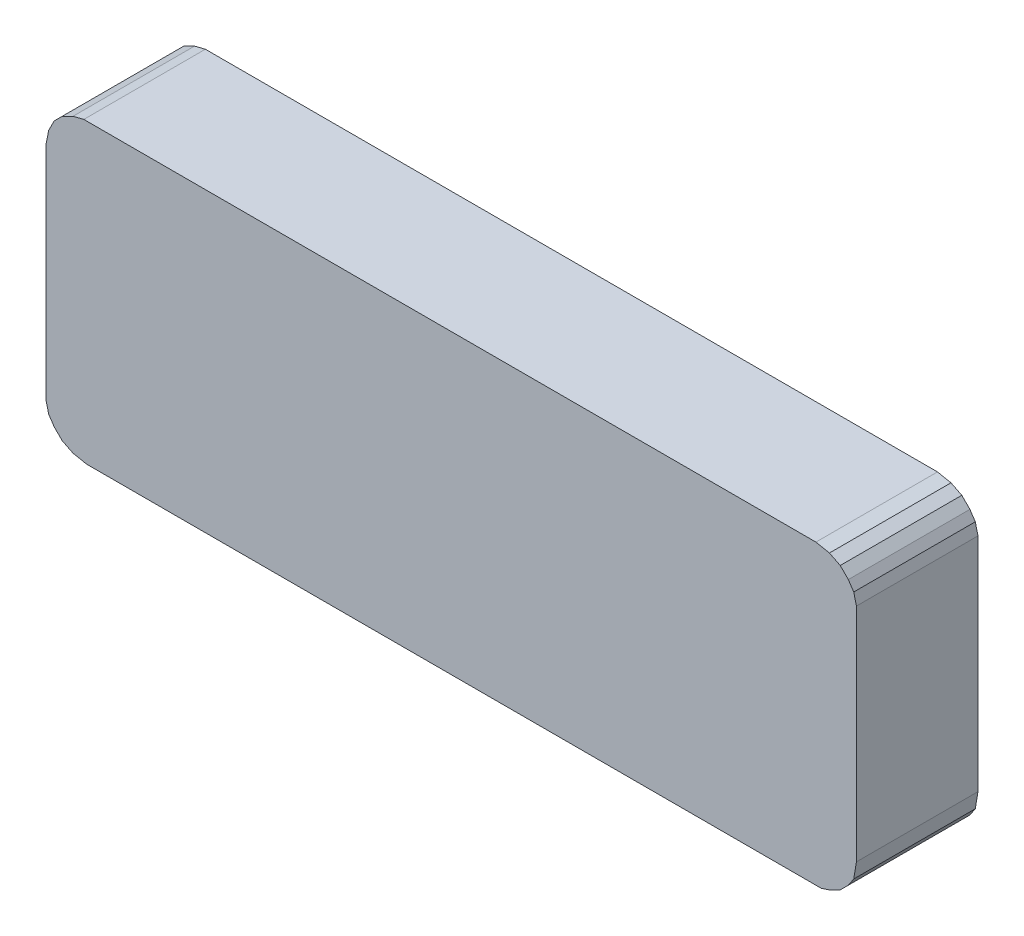
ISO-10303-21;
HEADER;
FILE_DESCRIPTION(('STEP AP214'),'2;1');
FILE_NAME('part.step','',(''),(''),'','','');
FILE_SCHEMA(('AUTOMOTIVE_DESIGN { 1 0 10303 214 1 1 1 1 }'));
ENDSEC;
DATA;
#1=APPLICATION_CONTEXT('core data for automotive mechanical design processes');
#2=APPLICATION_PROTOCOL_DEFINITION('international standard','automotive_design',2000,#1);
#3=PRODUCT_CONTEXT('',#1,'mechanical');
#4=PRODUCT('Part','Part','',(#3));
#5=PRODUCT_RELATED_PRODUCT_CATEGORY('part','',(#4));
#6=PRODUCT_DEFINITION_FORMATION('','',#4);
#7=PRODUCT_DEFINITION_CONTEXT('part definition',#1,'design');
#8=PRODUCT_DEFINITION('design','',#6,#7);
#9=PRODUCT_DEFINITION_SHAPE('','',#8);
#10=(LENGTH_UNIT() NAMED_UNIT(*) SI_UNIT(.MILLI.,.METRE.));
#11=(NAMED_UNIT(*) PLANE_ANGLE_UNIT() SI_UNIT($,.RADIAN.));
#12=(NAMED_UNIT(*) SI_UNIT($,.STERADIAN.) SOLID_ANGLE_UNIT());
#13=UNCERTAINTY_MEASURE_WITH_UNIT(LENGTH_MEASURE(1.E-05),#10,'distance_accuracy_value','');
#14=(GEOMETRIC_REPRESENTATION_CONTEXT(3) GLOBAL_UNCERTAINTY_ASSIGNED_CONTEXT((#13)) GLOBAL_UNIT_ASSIGNED_CONTEXT((#10,
#11,#12)) REPRESENTATION_CONTEXT('',''));
#15=CARTESIAN_POINT('',(0.,0.,0.));
#16=DIRECTION('',(0.,0.,1.));
#17=DIRECTION('',(1.,0.,0.));
#18=AXIS2_PLACEMENT_3D('',#15,#16,#17);
#19=CARTESIAN_POINT('',(-1.49999954,0.40000174,0.45));
#20=DIRECTION('',(0.,0.,1.));
#21=DIRECTION('',(1.,0.,0.));
#22=AXIS2_PLACEMENT_3D('',#19,#20,#21);
#23=PLANE('',#22);
#24=DIRECTION('',(-0.447213595499958,-0.894427190999916,0.));
#25=VECTOR('',#24,1.);
#26=CARTESIAN_POINT('',(-1.4699996,0.49000156,0.45));
#27=LINE('',#26,#25);
#28=CARTESIAN_POINT('',(-1.4699996,0.49000156,0.45));
#29=VERTEX_POINT('',#28);
#30=CARTESIAN_POINT('',(-1.48999956,0.45000164,0.45));
#31=VERTEX_POINT('',#30);
#32=EDGE_CURVE('E196',#29,#31,#27,.T.);
#33=ORIENTED_EDGE('',*,*,#32,.T.);
#34=DIRECTION('',(-0.196116135138182,-0.980580675690921,0.));
#35=VECTOR('',#34,1.);
#36=CARTESIAN_POINT('',(-1.48999956,0.45000164,0.45));
#37=LINE('',#36,#35);
#38=CARTESIAN_POINT('',(-1.49999954,0.40000174,0.45));
#39=VERTEX_POINT('',#38);
#40=EDGE_CURVE('E200',#31,#39,#37,.T.);
#41=ORIENTED_EDGE('',*,*,#40,.T.);
#42=DIRECTION('',(0.,1.,0.));
#43=VECTOR('',#42,1.);
#44=CARTESIAN_POINT('',(-1.49999954,-0.41999916,0.45));
#45=LINE('',#44,#43);
#46=CARTESIAN_POINT('',(-1.49999954,-0.419999159999998,0.45));
#47=VERTEX_POINT('',#46);
#48=EDGE_CURVE('E202',#47,#39,#45,.T.);
#49=ORIENTED_EDGE('',*,*,#48,.F.);
#50=DIRECTION('',(0.242535625036098,-0.970142500145391,0.));
#51=VECTOR('',#50,1.);
#52=CARTESIAN_POINT('',(-1.48999956,-0.45999908,0.45));
#53=LINE('',#52,#51);
#54=CARTESIAN_POINT('',(-1.48999956,-0.459999079999999,0.45));
#55=VERTEX_POINT('',#54);
#56=EDGE_CURVE('E205',#55,#47,#53,.F.);
#57=ORIENTED_EDGE('',*,*,#56,.F.);
#58=DIRECTION('',(0.554700196224998,-0.832050294337997,0.));
#59=VECTOR('',#58,1.);
#60=CARTESIAN_POINT('',(-1.4699996,-0.48999902,0.45));
#61=LINE('',#60,#59);
#62=CARTESIAN_POINT('',(-1.4699996,-0.48999902,0.45));
#63=VERTEX_POINT('',#62);
#64=EDGE_CURVE('E209',#63,#55,#61,.F.);
#65=ORIENTED_EDGE('',*,*,#64,.F.);
#66=DIRECTION('',(0.707106781186548,-0.707106781186548,0.));
#67=VECTOR('',#66,1.);
#68=CARTESIAN_POINT('',(-1.43999966,-0.51999896,0.45));
#69=LINE('',#68,#67);
#70=CARTESIAN_POINT('',(-1.43999966,-0.51999896,0.45));
#71=VERTEX_POINT('',#70);
#72=EDGE_CURVE('E213',#71,#63,#69,.F.);
#73=ORIENTED_EDGE('',*,*,#72,.F.);
#74=DIRECTION('',(0.894427190999916,-0.447213595499958,0.));
#75=VECTOR('',#74,1.);
#76=CARTESIAN_POINT('',(-1.39999974,-0.53999892,0.45));
#77=LINE('',#76,#75);
#78=CARTESIAN_POINT('',(-1.39999974,-0.539998920000002,0.45));
#79=VERTEX_POINT('',#78);
#80=EDGE_CURVE('E217',#79,#71,#77,.F.);
#81=ORIENTED_EDGE('',*,*,#80,.F.);
#82=DIRECTION('',(0.980580675690959,-0.196116135137992,0.));
#83=VECTOR('',#82,1.);
#84=CARTESIAN_POINT('',(-1.34999984,-0.5499989,0.45));
#85=LINE('',#84,#83);
#86=CARTESIAN_POINT('',(-1.34999984,-0.5499989,0.45));
#87=VERTEX_POINT('',#86);
#88=EDGE_CURVE('E221',#87,#79,#85,.F.);
#89=ORIENTED_EDGE('',*,*,#88,.F.);
#90=DIRECTION('',(1.,0.,0.));
#91=VECTOR('',#90,1.);
#92=CARTESIAN_POINT('',(1.3699998,-0.5499989,0.45));
#93=LINE('',#92,#91);
#94=CARTESIAN_POINT('',(1.3699998,-0.549998900000003,0.45));
#95=VERTEX_POINT('',#94);
#96=EDGE_CURVE('E225',#95,#87,#93,.F.);
#97=ORIENTED_EDGE('',*,*,#96,.F.);
#98=DIRECTION('',(0.948683298050414,0.316227766017138,0.));
#99=VECTOR('',#98,1.);
#100=CARTESIAN_POINT('',(1.39999974,-0.53999892,0.45));
#101=LINE('',#100,#99);
#102=CARTESIAN_POINT('',(1.39999974,-0.53999892,0.45));
#103=VERTEX_POINT('',#102);
#104=EDGE_CURVE('E229',#103,#95,#101,.F.);
#105=ORIENTED_EDGE('',*,*,#104,.F.);
#106=DIRECTION('',(0.894427190999916,0.447213595499958,0.));
#107=VECTOR('',#106,1.);
#108=CARTESIAN_POINT('',(1.43999966,-0.51999896,0.45));
#109=LINE('',#108,#107);
#110=CARTESIAN_POINT('',(1.43999965999999,-0.519998959999995,0.45));
#111=VERTEX_POINT('',#110);
#112=EDGE_CURVE('E233',#111,#103,#109,.F.);
#113=ORIENTED_EDGE('',*,*,#112,.F.);
#114=DIRECTION('',(0.707106781187048,0.707106781186048,0.));
#115=VECTOR('',#114,1.);
#116=CARTESIAN_POINT('',(1.4699996,-0.48999902,0.45));
#117=LINE('',#116,#115);
#118=CARTESIAN_POINT('',(1.4699996,-0.489999020000001,0.45));
#119=VERTEX_POINT('',#118);
#120=EDGE_CURVE('E237',#119,#111,#117,.F.);
#121=ORIENTED_EDGE('',*,*,#120,.F.);
#122=DIRECTION('',(0.554700196224998,0.832050294337997,0.));
#123=VECTOR('',#122,1.);
#124=CARTESIAN_POINT('',(1.48999956,-0.45999908,0.45));
#125=LINE('',#124,#123);
#126=CARTESIAN_POINT('',(1.48999956,-0.459999080000001,0.45));
#127=VERTEX_POINT('',#126);
#128=EDGE_CURVE('E241',#127,#119,#125,.F.);
#129=ORIENTED_EDGE('',*,*,#128,.F.);
#130=DIRECTION('',(0.164398987305033,0.986393923832198,0.));
#131=VECTOR('',#130,1.);
#132=CARTESIAN_POINT('',(1.49999954,-0.3999992,0.45));
#133=LINE('',#132,#131);
#134=CARTESIAN_POINT('',(1.49999954,-0.399999199999999,0.45));
#135=VERTEX_POINT('',#134);
#136=EDGE_CURVE('E245',#135,#127,#133,.F.);
#137=ORIENTED_EDGE('',*,*,#136,.F.);
#138=DIRECTION('',(0.,1.,0.));
#139=VECTOR('',#138,1.);
#140=CARTESIAN_POINT('',(1.49999954,0.4200017,0.45));
#141=LINE('',#140,#139);
#142=CARTESIAN_POINT('',(1.49999954,0.420001699999999,0.45));
#143=VERTEX_POINT('',#142);
#144=EDGE_CURVE('E249',#143,#135,#141,.F.);
#145=ORIENTED_EDGE('',*,*,#144,.F.);
#146=DIRECTION('',(-0.242535625036098,0.970142500145391,0.));
#147=VECTOR('',#146,1.);
#148=CARTESIAN_POINT('',(1.48999956,0.46000162,0.45));
#149=LINE('',#148,#147);
#150=CARTESIAN_POINT('',(1.48999956,0.460001619999999,0.45));
#151=VERTEX_POINT('',#150);
#152=EDGE_CURVE('E253',#151,#143,#149,.F.);
#153=ORIENTED_EDGE('',*,*,#152,.F.);
#154=DIRECTION('',(-0.554700196224998,0.832050294337997,0.));
#155=VECTOR('',#154,1.);
#156=CARTESIAN_POINT('',(1.4699996,0.49000156,0.45));
#157=LINE('',#156,#155);
#158=CARTESIAN_POINT('',(1.4699996,0.49000156,0.45));
#159=VERTEX_POINT('',#158);
#160=EDGE_CURVE('E257',#159,#151,#157,.F.);
#161=ORIENTED_EDGE('',*,*,#160,.F.);
#162=DIRECTION('',(-0.707106781186548,0.707106781186548,0.));
#163=VECTOR('',#162,1.);
#164=CARTESIAN_POINT('',(1.43999966,0.5200015,0.45));
#165=LINE('',#164,#163);
#166=CARTESIAN_POINT('',(1.43999966,0.5200015,0.45));
#167=VERTEX_POINT('',#166);
#168=EDGE_CURVE('E261',#167,#159,#165,.F.);
#169=ORIENTED_EDGE('',*,*,#168,.F.);
#170=DIRECTION('',(-0.894427190999916,0.447213595499958,0.));
#171=VECTOR('',#170,1.);
#172=CARTESIAN_POINT('',(1.39999974,0.54000146,0.45));
#173=LINE('',#172,#171);
#174=CARTESIAN_POINT('',(1.39999974,0.540001460000002,0.45));
#175=VERTEX_POINT('',#174);
#176=EDGE_CURVE('E265',#175,#167,#173,.F.);
#177=ORIENTED_EDGE('',*,*,#176,.F.);
#178=DIRECTION('',(-0.980580675690959,0.196116135137992,0.));
#179=VECTOR('',#178,1.);
#180=CARTESIAN_POINT('',(1.34999984,0.55000144,0.45));
#181=LINE('',#180,#179);
#182=CARTESIAN_POINT('',(1.34999984,0.55000144,0.45));
#183=VERTEX_POINT('',#182);
#184=EDGE_CURVE('E269',#183,#175,#181,.F.);
#185=ORIENTED_EDGE('',*,*,#184,.F.);
#186=DIRECTION('',(1.,0.,0.));
#187=VECTOR('',#186,1.);
#188=CARTESIAN_POINT('',(-1.35999982,0.55000144,0.45));
#189=LINE('',#188,#187);
#190=CARTESIAN_POINT('',(-1.35999982,0.550001439999997,0.45));
#191=VERTEX_POINT('',#190);
#192=EDGE_CURVE('E179',#191,#183,#189,.T.);
#193=ORIENTED_EDGE('',*,*,#192,.F.);
#194=DIRECTION('',(-0.970142500145332,-0.242535625036332,0.));
#195=VECTOR('',#194,1.);
#196=CARTESIAN_POINT('',(-1.35999982,0.55000144,0.45));
#197=LINE('',#196,#195);
#198=CARTESIAN_POINT('',(-1.39999974,0.54000146,0.45));
#199=VERTEX_POINT('',#198);
#200=EDGE_CURVE('E19',#191,#199,#197,.T.);
#201=ORIENTED_EDGE('',*,*,#200,.T.);
#202=DIRECTION('',(-0.894427190999917,-0.447213595499956,0.));
#203=VECTOR('',#202,1.);
#204=CARTESIAN_POINT('',(-1.39999974,0.54000146,0.45));
#205=LINE('',#204,#203);
#206=CARTESIAN_POINT('',(-1.43999966000001,0.520001500000005,0.45));
#207=VERTEX_POINT('',#206);
#208=EDGE_CURVE('E174',#199,#207,#205,.T.);
#209=ORIENTED_EDGE('',*,*,#208,.T.);
#210=DIRECTION('',(-0.707106781186546,-0.707106781186549,0.));
#211=VECTOR('',#210,1.);
#212=CARTESIAN_POINT('',(-1.43999966,0.5200015,0.45));
#213=LINE('',#212,#211);
#214=EDGE_CURVE('E195',#207,#29,#213,.T.);
#215=ORIENTED_EDGE('',*,*,#214,.T.);
#216=EDGE_LOOP('',(#33,#41,#49,#57,#65,#73,#81,#89,#97,#105,#113,#121,#129,#137,#145,#153,#161,
#169,#177,#185,#193,#201,#209,#215));
#217=FACE_BOUND('',#216,.T.);
#218=ADVANCED_FACE('F16',(#217),#23,.T.);
#219=CARTESIAN_POINT('',(-1.49999954,-0.41999916,0.));
#220=DIRECTION('',(-1.,0.,0.));
#221=DIRECTION('',(0.,0.,1.));
#222=AXIS2_PLACEMENT_3D('',#219,#220,#221);
#223=PLANE('',#222);
#224=DIRECTION('',(0.,0.,1.));
#225=VECTOR('',#224,1.);
#226=CARTESIAN_POINT('',(-1.49999954,0.40000174,0.));
#227=LINE('',#226,#225);
#228=CARTESIAN_POINT('',(-1.49999954,0.40000174,0.));
#229=VERTEX_POINT('',#228);
#230=EDGE_CURVE('E280',#229,#39,#227,.T.);
#231=ORIENTED_EDGE('',*,*,#230,.F.);
#232=DIRECTION('',(0.,1.,0.));
#233=VECTOR('',#232,1.);
#234=CARTESIAN_POINT('',(-1.49999954,0.40000174,0.));
#235=LINE('',#234,#233);
#236=CARTESIAN_POINT('',(-1.49999954,-0.419999159999999,0.));
#237=VERTEX_POINT('',#236);
#238=EDGE_CURVE('E284',#229,#237,#235,.F.);
#239=ORIENTED_EDGE('',*,*,#238,.T.);
#240=DIRECTION('',(0.,0.,1.));
#241=VECTOR('',#240,1.);
#242=CARTESIAN_POINT('',(-1.49999953999999,-0.419999159999998,0.));
#243=LINE('',#242,#241);
#244=EDGE_CURVE('E207',#47,#237,#243,.F.);
#245=ORIENTED_EDGE('',*,*,#244,.F.);
#246=ORIENTED_EDGE('',*,*,#48,.T.);
#247=EDGE_LOOP('',(#231,#239,#245,#246));
#248=FACE_BOUND('',#247,.T.);
#249=ADVANCED_FACE('F363',(#248),#223,.T.);
#250=CARTESIAN_POINT('',(-1.48999956,-0.45999908,0.));
#251=DIRECTION('',(-0.970142500145391,-0.242535625036098,0.));
#252=DIRECTION('',(0.242535625036098,-0.970142500145391,0.));
#253=AXIS2_PLACEMENT_3D('',#250,#251,#252);
#254=PLANE('',#253);
#255=ORIENTED_EDGE('',*,*,#244,.T.);
#256=DIRECTION('',(0.24253562503633,-0.970142500145333,0.));
#257=VECTOR('',#256,1.);
#258=CARTESIAN_POINT('',(-1.49999954,-0.41999916,0.));
#259=LINE('',#258,#257);
#260=CARTESIAN_POINT('',(-1.48999956,-0.459999079999999,0.));
#261=VERTEX_POINT('',#260);
#262=EDGE_CURVE('E287',#237,#261,#259,.T.);
#263=ORIENTED_EDGE('',*,*,#262,.T.);
#264=DIRECTION('',(0.,0.,1.));
#265=VECTOR('',#264,1.);
#266=CARTESIAN_POINT('',(-1.48999955999999,-0.459999079999994,0.));
#267=LINE('',#266,#265);
#268=EDGE_CURVE('E211',#55,#261,#267,.F.);
#269=ORIENTED_EDGE('',*,*,#268,.F.);
#270=ORIENTED_EDGE('',*,*,#56,.T.);
#271=EDGE_LOOP('',(#255,#263,#269,#270));
#272=FACE_BOUND('',#271,.T.);
#273=ADVANCED_FACE('F448',(#272),#254,.T.);
#274=CARTESIAN_POINT('',(-1.4699996,-0.48999902,0.));
#275=DIRECTION('',(-0.832050294337997,-0.554700196224998,0.));
#276=DIRECTION('',(0.554700196224998,-0.832050294337997,0.));
#277=AXIS2_PLACEMENT_3D('',#274,#275,#276);
#278=PLANE('',#277);
#279=ORIENTED_EDGE('',*,*,#268,.T.);
#280=DIRECTION('',(0.55470019622523,-0.832050294337843,0.));
#281=VECTOR('',#280,1.);
#282=CARTESIAN_POINT('',(-1.48999956,-0.45999908,0.));
#283=LINE('',#282,#281);
#284=CARTESIAN_POINT('',(-1.4699996,-0.48999902,0.));
#285=VERTEX_POINT('',#284);
#286=EDGE_CURVE('E290',#261,#285,#283,.T.);
#287=ORIENTED_EDGE('',*,*,#286,.T.);
#288=DIRECTION('',(0.,0.,1.));
#289=VECTOR('',#288,1.);
#290=CARTESIAN_POINT('',(-1.4699996,-0.48999902,0.));
#291=LINE('',#290,#289);
#292=EDGE_CURVE('E215',#63,#285,#291,.F.);
#293=ORIENTED_EDGE('',*,*,#292,.F.);
#294=ORIENTED_EDGE('',*,*,#64,.T.);
#295=EDGE_LOOP('',(#279,#287,#293,#294));
#296=FACE_BOUND('',#295,.T.);
#297=ADVANCED_FACE('F444',(#296),#278,.T.);
#298=CARTESIAN_POINT('',(-1.43999966,-0.51999896,0.));
#299=DIRECTION('',(-0.707106781186548,-0.707106781186548,0.));
#300=DIRECTION('',(0.707106781186548,-0.707106781186548,0.));
#301=AXIS2_PLACEMENT_3D('',#298,#299,#300);
#302=PLANE('',#301);
#303=ORIENTED_EDGE('',*,*,#292,.T.);
#304=DIRECTION('',(0.707106781186545,-0.70710678118655,0.));
#305=VECTOR('',#304,1.);
#306=CARTESIAN_POINT('',(-1.4699996,-0.48999902,0.));
#307=LINE('',#306,#305);
#308=CARTESIAN_POINT('',(-1.43999966,-0.51999896,0.));
#309=VERTEX_POINT('',#308);
#310=EDGE_CURVE('E293',#285,#309,#307,.T.);
#311=ORIENTED_EDGE('',*,*,#310,.T.);
#312=DIRECTION('',(0.,0.,1.));
#313=VECTOR('',#312,1.);
#314=CARTESIAN_POINT('',(-1.43999966,-0.51999896,0.));
#315=LINE('',#314,#313);
#316=EDGE_CURVE('E219',#71,#309,#315,.F.);
#317=ORIENTED_EDGE('',*,*,#316,.F.);
#318=ORIENTED_EDGE('',*,*,#72,.T.);
#319=EDGE_LOOP('',(#303,#311,#317,#318));
#320=FACE_BOUND('',#319,.T.);
#321=ADVANCED_FACE('F440',(#320),#302,.T.);
#322=CARTESIAN_POINT('',(-1.39999974,-0.53999892,0.));
#323=DIRECTION('',(-0.447213595499958,-0.894427190999916,0.));
#324=DIRECTION('',(0.894427190999916,-0.447213595499958,0.));
#325=AXIS2_PLACEMENT_3D('',#322,#323,#324);
#326=PLANE('',#325);
#327=ORIENTED_EDGE('',*,*,#316,.T.);
#328=DIRECTION('',(0.894427190999917,-0.447213595499956,0.));
#329=VECTOR('',#328,1.);
#330=CARTESIAN_POINT('',(-1.43999966,-0.51999896,0.));
#331=LINE('',#330,#329);
#332=CARTESIAN_POINT('',(-1.39999974,-0.539998920000002,0.));
#333=VERTEX_POINT('',#332);
#334=EDGE_CURVE('E296',#309,#333,#331,.T.);
#335=ORIENTED_EDGE('',*,*,#334,.T.);
#336=DIRECTION('',(0.,0.,1.));
#337=VECTOR('',#336,1.);
#338=CARTESIAN_POINT('',(-1.39999974,-0.53999892000001,0.));
#339=LINE('',#338,#337);
#340=EDGE_CURVE('E223',#79,#333,#339,.F.);
#341=ORIENTED_EDGE('',*,*,#340,.F.);
#342=ORIENTED_EDGE('',*,*,#80,.T.);
#343=EDGE_LOOP('',(#327,#335,#341,#342));
#344=FACE_BOUND('',#343,.T.);
#345=ADVANCED_FACE('F436',(#344),#326,.T.);
#346=CARTESIAN_POINT('',(-1.34999984,-0.5499989,0.));
#347=DIRECTION('',(-0.196116135137992,-0.980580675690959,0.));
#348=DIRECTION('',(0.980580675690959,-0.196116135137992,0.));
#349=AXIS2_PLACEMENT_3D('',#346,#347,#348);
#350=PLANE('',#349);
#351=ORIENTED_EDGE('',*,*,#340,.T.);
#352=DIRECTION('',(0.980580675690921,-0.196116135138182,0.));
#353=VECTOR('',#352,1.);
#354=CARTESIAN_POINT('',(-1.39999974,-0.53999892,0.));
#355=LINE('',#354,#353);
#356=CARTESIAN_POINT('',(-1.34999984,-0.5499989,0.));
#357=VERTEX_POINT('',#356);
#358=EDGE_CURVE('E299',#333,#357,#355,.T.);
#359=ORIENTED_EDGE('',*,*,#358,.T.);
#360=DIRECTION('',(0.,0.,-1.));
#361=VECTOR('',#360,1.);
#362=CARTESIAN_POINT('',(-1.34999984,-0.5499989,0.));
#363=LINE('',#362,#361);
#364=EDGE_CURVE('E227',#87,#357,#363,.T.);
#365=ORIENTED_EDGE('',*,*,#364,.F.);
#366=ORIENTED_EDGE('',*,*,#88,.T.);
#367=EDGE_LOOP('',(#351,#359,#365,#366));
#368=FACE_BOUND('',#367,.T.);
#369=ADVANCED_FACE('F432',(#368),#350,.T.);
#370=CARTESIAN_POINT('',(1.3699998,-0.5499989,0.));
#371=DIRECTION('',(0.,-1.,0.));
#372=DIRECTION('',(0.,0.,-1.));
#373=AXIS2_PLACEMENT_3D('',#370,#371,#372);
#374=PLANE('',#373);
#375=ORIENTED_EDGE('',*,*,#364,.T.);
#376=DIRECTION('',(1.,0.,0.));
#377=VECTOR('',#376,1.);
#378=CARTESIAN_POINT('',(-1.49999954,-0.5499989,0.));
#379=LINE('',#378,#377);
#380=CARTESIAN_POINT('',(1.3699998,-0.549998900000003,0.));
#381=VERTEX_POINT('',#380);
#382=EDGE_CURVE('E302',#357,#381,#379,.T.);
#383=ORIENTED_EDGE('',*,*,#382,.T.);
#384=DIRECTION('',(0.,0.,1.));
#385=VECTOR('',#384,1.);
#386=CARTESIAN_POINT('',(1.3699998,-0.54999890000001,0.));
#387=LINE('',#386,#385);
#388=EDGE_CURVE('E231',#95,#381,#387,.F.);
#389=ORIENTED_EDGE('',*,*,#388,.F.);
#390=ORIENTED_EDGE('',*,*,#96,.T.);
#391=EDGE_LOOP('',(#375,#383,#389,#390));
#392=FACE_BOUND('',#391,.T.);
#393=ADVANCED_FACE('F428',(#392),#374,.T.);
#394=CARTESIAN_POINT('',(1.39999974,-0.53999892,0.));
#395=DIRECTION('',(0.316227766017138,-0.948683298050414,0.));
#396=DIRECTION('',(0.948683298050414,0.316227766017138,0.));
#397=AXIS2_PLACEMENT_3D('',#394,#395,#396);
#398=PLANE('',#397);
#399=ORIENTED_EDGE('',*,*,#388,.T.);
#400=DIRECTION('',(0.948683298050515,0.316227766016836,0.));
#401=VECTOR('',#400,1.);
#402=CARTESIAN_POINT('',(1.3699998,-0.5499989,0.));
#403=LINE('',#402,#401);
#404=CARTESIAN_POINT('',(1.39999974,-0.53999892,0.));
#405=VERTEX_POINT('',#404);
#406=EDGE_CURVE('E305',#381,#405,#403,.T.);
#407=ORIENTED_EDGE('',*,*,#406,.T.);
#408=DIRECTION('',(0.,0.,1.));
#409=VECTOR('',#408,1.);
#410=CARTESIAN_POINT('',(1.39999974,-0.53999892,0.));
#411=LINE('',#410,#409);
#412=EDGE_CURVE('E235',#103,#405,#411,.F.);
#413=ORIENTED_EDGE('',*,*,#412,.F.);
#414=ORIENTED_EDGE('',*,*,#104,.T.);
#415=EDGE_LOOP('',(#399,#407,#413,#414));
#416=FACE_BOUND('',#415,.T.);
#417=ADVANCED_FACE('F424',(#416),#398,.T.);
#418=CARTESIAN_POINT('',(1.43999966,-0.51999896,0.));
#419=DIRECTION('',(0.447213595499958,-0.894427190999916,0.));
#420=DIRECTION('',(0.894427190999916,0.447213595499958,0.));
#421=AXIS2_PLACEMENT_3D('',#418,#419,#420);
#422=PLANE('',#421);
#423=ORIENTED_EDGE('',*,*,#412,.T.);
#424=DIRECTION('',(0.894427190999916,0.447213595499958,0.));
#425=VECTOR('',#424,1.);
#426=CARTESIAN_POINT('',(1.39999974,-0.53999892,0.));
#427=LINE('',#426,#425);
#428=CARTESIAN_POINT('',(1.43999965999999,-0.519998959999995,0.));
#429=VERTEX_POINT('',#428);
#430=EDGE_CURVE('E308',#405,#429,#427,.T.);
#431=ORIENTED_EDGE('',*,*,#430,.T.);
#432=DIRECTION('',(0.,0.,1.));
#433=VECTOR('',#432,1.);
#434=CARTESIAN_POINT('',(1.43999965999998,-0.519998959999979,0.));
#435=LINE('',#434,#433);
#436=EDGE_CURVE('E239',#111,#429,#435,.F.);
#437=ORIENTED_EDGE('',*,*,#436,.F.);
#438=ORIENTED_EDGE('',*,*,#112,.T.);
#439=EDGE_LOOP('',(#423,#431,#437,#438));
#440=FACE_BOUND('',#439,.T.);
#441=ADVANCED_FACE('F420',(#440),#422,.T.);
#442=CARTESIAN_POINT('',(1.4699996,-0.48999902,0.));
#443=DIRECTION('',(0.707106781186048,-0.707106781187048,0.));
#444=DIRECTION('',(0.707106781187048,0.707106781186048,0.));
#445=AXIS2_PLACEMENT_3D('',#442,#443,#444);
#446=PLANE('',#445);
#447=ORIENTED_EDGE('',*,*,#436,.T.);
#448=DIRECTION('',(0.707106781186545,0.70710678118655,0.));
#449=VECTOR('',#448,1.);
#450=CARTESIAN_POINT('',(1.43999966,-0.51999896,0.));
#451=LINE('',#450,#449);
#452=CARTESIAN_POINT('',(1.4699996,-0.489999020000001,0.));
#453=VERTEX_POINT('',#452);
#454=EDGE_CURVE('E311',#429,#453,#451,.T.);
#455=ORIENTED_EDGE('',*,*,#454,.T.);
#456=DIRECTION('',(0.,0.,1.));
#457=VECTOR('',#456,1.);
#458=CARTESIAN_POINT('',(1.46999960000001,-0.489999020000006,0.));
#459=LINE('',#458,#457);
#460=EDGE_CURVE('E243',#119,#453,#459,.F.);
#461=ORIENTED_EDGE('',*,*,#460,.F.);
#462=ORIENTED_EDGE('',*,*,#120,.T.);
#463=EDGE_LOOP('',(#447,#455,#461,#462));
#464=FACE_BOUND('',#463,.T.);
#465=ADVANCED_FACE('F416',(#464),#446,.T.);
#466=CARTESIAN_POINT('',(1.48999956,-0.45999908,0.));
#467=DIRECTION('',(0.832050294337997,-0.554700196224998,0.));
#468=DIRECTION('',(0.554700196224998,0.832050294337997,0.));
#469=AXIS2_PLACEMENT_3D('',#466,#467,#468);
#470=PLANE('',#469);
#471=ORIENTED_EDGE('',*,*,#460,.T.);
#472=DIRECTION('',(0.554700196225226,0.832050294337846,0.));
#473=VECTOR('',#472,1.);
#474=CARTESIAN_POINT('',(1.4699996,-0.48999902,0.));
#475=LINE('',#474,#473);
#476=CARTESIAN_POINT('',(1.48999956,-0.459999080000001,0.));
#477=VERTEX_POINT('',#476);
#478=EDGE_CURVE('E314',#453,#477,#475,.T.);
#479=ORIENTED_EDGE('',*,*,#478,.T.);
#480=DIRECTION('',(0.,0.,1.));
#481=VECTOR('',#480,1.);
#482=CARTESIAN_POINT('',(1.48999956000002,-0.459999080000003,0.));
#483=LINE('',#482,#481);
#484=EDGE_CURVE('E247',#127,#477,#483,.F.);
#485=ORIENTED_EDGE('',*,*,#484,.F.);
#486=ORIENTED_EDGE('',*,*,#128,.T.);
#487=EDGE_LOOP('',(#471,#479,#485,#486));
#488=FACE_BOUND('',#487,.T.);
#489=ADVANCED_FACE('F412',(#488),#470,.T.);
#490=CARTESIAN_POINT('',(1.49999954,-0.3999992,0.));
#491=DIRECTION('',(0.986393923832198,-0.164398987305033,0.));
#492=DIRECTION('',(0.164398987305033,0.986393923832198,0.));
#493=AXIS2_PLACEMENT_3D('',#490,#491,#492);
#494=PLANE('',#493);
#495=ORIENTED_EDGE('',*,*,#484,.T.);
#496=DIRECTION('',(0.164398987305359,0.986393923832143,0.));
#497=VECTOR('',#496,1.);
#498=CARTESIAN_POINT('',(1.48999956,-0.45999908,0.));
#499=LINE('',#498,#497);
#500=CARTESIAN_POINT('',(1.49999954,-0.3999992,0.));
#501=VERTEX_POINT('',#500);
#502=EDGE_CURVE('E317',#477,#501,#499,.T.);
#503=ORIENTED_EDGE('',*,*,#502,.T.);
#504=DIRECTION('',(0.,0.,-1.));
#505=VECTOR('',#504,1.);
#506=CARTESIAN_POINT('',(1.49999954,-0.3999992,0.));
#507=LINE('',#506,#505);
#508=EDGE_CURVE('E251',#135,#501,#507,.T.);
#509=ORIENTED_EDGE('',*,*,#508,.F.);
#510=ORIENTED_EDGE('',*,*,#136,.T.);
#511=EDGE_LOOP('',(#495,#503,#509,#510));
#512=FACE_BOUND('',#511,.T.);
#513=ADVANCED_FACE('F408',(#512),#494,.T.);
#514=CARTESIAN_POINT('',(1.49999954,0.4200017,0.));
#515=DIRECTION('',(1.,0.,0.));
#516=DIRECTION('',(0.,0.,-1.));
#517=AXIS2_PLACEMENT_3D('',#514,#515,#516);
#518=PLANE('',#517);
#519=ORIENTED_EDGE('',*,*,#508,.T.);
#520=DIRECTION('',(0.,1.,0.));
#521=VECTOR('',#520,1.);
#522=CARTESIAN_POINT('',(1.49999954,0.40000174,0.));
#523=LINE('',#522,#521);
#524=CARTESIAN_POINT('',(1.49999954,0.420001699999999,0.));
#525=VERTEX_POINT('',#524);
#526=EDGE_CURVE('E320',#501,#525,#523,.T.);
#527=ORIENTED_EDGE('',*,*,#526,.T.);
#528=DIRECTION('',(0.,0.,1.));
#529=VECTOR('',#528,1.);
#530=CARTESIAN_POINT('',(1.49999953999999,0.420001699999998,0.));
#531=LINE('',#530,#529);
#532=EDGE_CURVE('E255',#143,#525,#531,.F.);
#533=ORIENTED_EDGE('',*,*,#532,.F.);
#534=ORIENTED_EDGE('',*,*,#144,.T.);
#535=EDGE_LOOP('',(#519,#527,#533,#534));
#536=FACE_BOUND('',#535,.T.);
#537=ADVANCED_FACE('F404',(#536),#518,.T.);
#538=CARTESIAN_POINT('',(1.48999956,0.46000162,0.));
#539=DIRECTION('',(0.970142500145391,0.242535625036098,0.));
#540=DIRECTION('',(-0.242535625036098,0.970142500145391,0.));
#541=AXIS2_PLACEMENT_3D('',#538,#539,#540);
#542=PLANE('',#541);
#543=ORIENTED_EDGE('',*,*,#532,.T.);
#544=DIRECTION('',(-0.242535625036335,0.970142500145331,0.));
#545=VECTOR('',#544,1.);
#546=CARTESIAN_POINT('',(1.49999954,0.4200017,0.));
#547=LINE('',#546,#545);
#548=CARTESIAN_POINT('',(1.48999956,0.460001619999999,0.));
#549=VERTEX_POINT('',#548);
#550=EDGE_CURVE('E323',#525,#549,#547,.T.);
#551=ORIENTED_EDGE('',*,*,#550,.T.);
#552=DIRECTION('',(0.,0.,1.));
#553=VECTOR('',#552,1.);
#554=CARTESIAN_POINT('',(1.48999955999999,0.460001619999994,0.));
#555=LINE('',#554,#553);
#556=EDGE_CURVE('E259',#151,#549,#555,.F.);
#557=ORIENTED_EDGE('',*,*,#556,.F.);
#558=ORIENTED_EDGE('',*,*,#152,.T.);
#559=EDGE_LOOP('',(#543,#551,#557,#558));
#560=FACE_BOUND('',#559,.T.);
#561=ADVANCED_FACE('F400',(#560),#542,.T.);
#562=CARTESIAN_POINT('',(1.4699996,0.49000156,0.));
#563=DIRECTION('',(0.832050294337997,0.554700196224998,0.));
#564=DIRECTION('',(-0.554700196224998,0.832050294337997,0.));
#565=AXIS2_PLACEMENT_3D('',#562,#563,#564);
#566=PLANE('',#565);
#567=ORIENTED_EDGE('',*,*,#556,.T.);
#568=DIRECTION('',(-0.554700196225224,0.832050294337847,0.));
#569=VECTOR('',#568,1.);
#570=CARTESIAN_POINT('',(1.48999956,0.46000162,0.));
#571=LINE('',#570,#569);
#572=CARTESIAN_POINT('',(1.4699996,0.49000156,0.));
#573=VERTEX_POINT('',#572);
#574=EDGE_CURVE('E326',#549,#573,#571,.T.);
#575=ORIENTED_EDGE('',*,*,#574,.T.);
#576=DIRECTION('',(0.,0.,1.));
#577=VECTOR('',#576,1.);
#578=CARTESIAN_POINT('',(1.4699996,0.49000156,0.));
#579=LINE('',#578,#577);
#580=EDGE_CURVE('E263',#159,#573,#579,.F.);
#581=ORIENTED_EDGE('',*,*,#580,.F.);
#582=ORIENTED_EDGE('',*,*,#160,.T.);
#583=EDGE_LOOP('',(#567,#575,#581,#582));
#584=FACE_BOUND('',#583,.T.);
#585=ADVANCED_FACE('F396',(#584),#566,.T.);
#586=CARTESIAN_POINT('',(1.43999966,0.5200015,0.));
#587=DIRECTION('',(0.707106781186548,0.707106781186548,0.));
#588=DIRECTION('',(-0.707106781186548,0.707106781186548,0.));
#589=AXIS2_PLACEMENT_3D('',#586,#587,#588);
#590=PLANE('',#589);
#591=ORIENTED_EDGE('',*,*,#580,.T.);
#592=DIRECTION('',(-0.707106781186546,0.707106781186549,0.));
#593=VECTOR('',#592,1.);
#594=CARTESIAN_POINT('',(1.4699996,0.49000156,0.));
#595=LINE('',#594,#593);
#596=CARTESIAN_POINT('',(1.43999966,0.5200015,0.));
#597=VERTEX_POINT('',#596);
#598=EDGE_CURVE('E329',#573,#597,#595,.T.);
#599=ORIENTED_EDGE('',*,*,#598,.T.);
#600=DIRECTION('',(0.,0.,1.));
#601=VECTOR('',#600,1.);
#602=CARTESIAN_POINT('',(1.43999966,0.5200015,0.));
#603=LINE('',#602,#601);
#604=EDGE_CURVE('E267',#167,#597,#603,.F.);
#605=ORIENTED_EDGE('',*,*,#604,.F.);
#606=ORIENTED_EDGE('',*,*,#168,.T.);
#607=EDGE_LOOP('',(#591,#599,#605,#606));
#608=FACE_BOUND('',#607,.T.);
#609=ADVANCED_FACE('F392',(#608),#590,.T.);
#610=CARTESIAN_POINT('',(1.39999974,0.54000146,0.));
#611=DIRECTION('',(0.447213595499958,0.894427190999916,0.));
#612=DIRECTION('',(-0.894427190999916,0.447213595499958,0.));
#613=AXIS2_PLACEMENT_3D('',#610,#611,#612);
#614=PLANE('',#613);
#615=ORIENTED_EDGE('',*,*,#604,.T.);
#616=DIRECTION('',(-0.894427190999916,0.447213595499958,0.));
#617=VECTOR('',#616,1.);
#618=CARTESIAN_POINT('',(1.43999966,0.5200015,0.));
#619=LINE('',#618,#617);
#620=CARTESIAN_POINT('',(1.39999974,0.540001460000002,0.));
#621=VERTEX_POINT('',#620);
#622=EDGE_CURVE('E332',#597,#621,#619,.T.);
#623=ORIENTED_EDGE('',*,*,#622,.T.);
#624=DIRECTION('',(0.,0.,1.));
#625=VECTOR('',#624,1.);
#626=CARTESIAN_POINT('',(1.39999974,0.54000146000001,0.));
#627=LINE('',#626,#625);
#628=EDGE_CURVE('E271',#175,#621,#627,.F.);
#629=ORIENTED_EDGE('',*,*,#628,.F.);
#630=ORIENTED_EDGE('',*,*,#176,.T.);
#631=EDGE_LOOP('',(#615,#623,#629,#630));
#632=FACE_BOUND('',#631,.T.);
#633=ADVANCED_FACE('F388',(#632),#614,.T.);
#634=CARTESIAN_POINT('',(1.34999984,0.55000144,0.));
#635=DIRECTION('',(0.196116135137992,0.980580675690959,0.));
#636=DIRECTION('',(-0.980580675690959,0.196116135137992,0.));
#637=AXIS2_PLACEMENT_3D('',#634,#635,#636);
#638=PLANE('',#637);
#639=ORIENTED_EDGE('',*,*,#628,.T.);
#640=DIRECTION('',(-0.980580675690921,0.196116135138182,0.));
#641=VECTOR('',#640,1.);
#642=CARTESIAN_POINT('',(1.39999974,0.54000146,0.));
#643=LINE('',#642,#641);
#644=CARTESIAN_POINT('',(1.34999984,0.55000144,0.));
#645=VERTEX_POINT('',#644);
#646=EDGE_CURVE('E335',#621,#645,#643,.T.);
#647=ORIENTED_EDGE('',*,*,#646,.T.);
#648=DIRECTION('',(0.,0.,1.));
#649=VECTOR('',#648,1.);
#650=CARTESIAN_POINT('',(1.34999984,0.55000144,0.));
#651=LINE('',#650,#649);
#652=EDGE_CURVE('E274',#183,#645,#651,.F.);
#653=ORIENTED_EDGE('',*,*,#652,.F.);
#654=ORIENTED_EDGE('',*,*,#184,.T.);
#655=EDGE_LOOP('',(#639,#647,#653,#654));
#656=FACE_BOUND('',#655,.T.);
#657=ADVANCED_FACE('F384',(#656),#638,.T.);
#658=CARTESIAN_POINT('',(-1.35999982,0.55000144,0.));
#659=DIRECTION('',(0.,1.,0.));
#660=DIRECTION('',(0.,0.,1.));
#661=AXIS2_PLACEMENT_3D('',#658,#659,#660);
#662=PLANE('',#661);
#663=ORIENTED_EDGE('',*,*,#652,.T.);
#664=DIRECTION('',(1.,0.,0.));
#665=VECTOR('',#664,1.);
#666=CARTESIAN_POINT('',(-1.49999954,0.55000144,0.));
#667=LINE('',#666,#665);
#668=CARTESIAN_POINT('',(-1.35999982,0.550001439999997,0.));
#669=VERTEX_POINT('',#668);
#670=EDGE_CURVE('E338',#645,#669,#667,.F.);
#671=ORIENTED_EDGE('',*,*,#670,.T.);
#672=DIRECTION('',(0.,0.,1.));
#673=VECTOR('',#672,1.);
#674=CARTESIAN_POINT('',(-1.35999982,0.55000143999999,0.));
#675=LINE('',#674,#673);
#676=EDGE_CURVE('E191',#191,#669,#675,.F.);
#677=ORIENTED_EDGE('',*,*,#676,.F.);
#678=ORIENTED_EDGE('',*,*,#192,.T.);
#679=EDGE_LOOP('',(#663,#671,#677,#678));
#680=FACE_BOUND('',#679,.T.);
#681=ADVANCED_FACE('F381',(#680),#662,.T.);
#682=CARTESIAN_POINT('',(-1.39999974,0.54000146,0.));
#683=DIRECTION('',(-0.242535625036098,0.970142500145391,0.));
#684=DIRECTION('',(-0.970142500145391,-0.242535625036098,0.));
#685=AXIS2_PLACEMENT_3D('',#682,#683,#684);
#686=PLANE('',#685);
#687=ORIENTED_EDGE('',*,*,#676,.T.);
#688=DIRECTION('',(-0.970142500145332,-0.242535625036332,0.));
#689=VECTOR('',#688,1.);
#690=CARTESIAN_POINT('',(-1.35999982,0.55000144,0.));
#691=LINE('',#690,#689);
#692=CARTESIAN_POINT('',(-1.39999974,0.54000146,0.));
#693=VERTEX_POINT('',#692);
#694=EDGE_CURVE('E186',#669,#693,#691,.T.);
#695=ORIENTED_EDGE('',*,*,#694,.T.);
#696=DIRECTION('',(0.,0.,1.));
#697=VECTOR('',#696,1.);
#698=CARTESIAN_POINT('',(-1.39999974,0.54000146,0.));
#699=LINE('',#698,#697);
#700=EDGE_CURVE('E183',#199,#693,#699,.F.);
#701=ORIENTED_EDGE('',*,*,#700,.F.);
#702=ORIENTED_EDGE('',*,*,#200,.F.);
#703=EDGE_LOOP('',(#687,#695,#701,#702));
#704=FACE_BOUND('',#703,.T.);
#705=ADVANCED_FACE('F184',(#704),#686,.T.);
#706=CARTESIAN_POINT('',(-1.43999966,0.5200015,0.));
#707=DIRECTION('',(-0.447213595499958,0.894427190999916,0.));
#708=DIRECTION('',(-0.894427190999916,-0.447213595499958,0.));
#709=AXIS2_PLACEMENT_3D('',#706,#707,#708);
#710=PLANE('',#709);
#711=ORIENTED_EDGE('',*,*,#700,.T.);
#712=DIRECTION('',(-0.894427190999917,-0.447213595499956,0.));
#713=VECTOR('',#712,1.);
#714=CARTESIAN_POINT('',(-1.39999974,0.54000146,0.));
#715=LINE('',#714,#713);
#716=CARTESIAN_POINT('',(-1.43999966000001,0.520001500000005,0.));
#717=VERTEX_POINT('',#716);
#718=EDGE_CURVE('E342',#693,#717,#715,.T.);
#719=ORIENTED_EDGE('',*,*,#718,.T.);
#720=DIRECTION('',(0.,0.,1.));
#721=VECTOR('',#720,1.);
#722=CARTESIAN_POINT('',(-1.43999966000002,0.520001500000021,0.));
#723=LINE('',#722,#721);
#724=EDGE_CURVE('E190',#207,#717,#723,.F.);
#725=ORIENTED_EDGE('',*,*,#724,.F.);
#726=ORIENTED_EDGE('',*,*,#208,.F.);
#727=EDGE_LOOP('',(#711,#719,#725,#726));
#728=FACE_BOUND('',#727,.T.);
#729=ADVANCED_FACE('F193',(#728),#710,.T.);
#730=CARTESIAN_POINT('',(-1.4699996,0.49000156,0.));
#731=DIRECTION('',(-0.707106781187048,0.707106781186048,0.));
#732=DIRECTION('',(-0.707106781186048,-0.707106781187048,0.));
#733=AXIS2_PLACEMENT_3D('',#730,#731,#732);
#734=PLANE('',#733);
#735=ORIENTED_EDGE('',*,*,#724,.T.);
#736=DIRECTION('',(-0.707106781186546,-0.707106781186549,0.));
#737=VECTOR('',#736,1.);
#738=CARTESIAN_POINT('',(-1.43999966,0.5200015,0.));
#739=LINE('',#738,#737);
#740=CARTESIAN_POINT('',(-1.4699996,0.49000156,0.));
#741=VERTEX_POINT('',#740);
#742=EDGE_CURVE('E344',#717,#741,#739,.T.);
#743=ORIENTED_EDGE('',*,*,#742,.T.);
#744=DIRECTION('',(0.,0.,1.));
#745=VECTOR('',#744,1.);
#746=CARTESIAN_POINT('',(-1.4699996,0.49000156,0.));
#747=LINE('',#746,#745);
#748=EDGE_CURVE('E278',#29,#741,#747,.F.);
#749=ORIENTED_EDGE('',*,*,#748,.F.);
#750=ORIENTED_EDGE('',*,*,#214,.F.);
#751=EDGE_LOOP('',(#735,#743,#749,#750));
#752=FACE_BOUND('',#751,.T.);
#753=ADVANCED_FACE('F357',(#752),#734,.T.);
#754=CARTESIAN_POINT('',(-1.48999956,0.45000164,0.));
#755=DIRECTION('',(-0.894427190999916,0.447213595499958,0.));
#756=DIRECTION('',(-0.447213595499958,-0.894427190999916,0.));
#757=AXIS2_PLACEMENT_3D('',#754,#755,#756);
#758=PLANE('',#757);
#759=ORIENTED_EDGE('',*,*,#748,.T.);
#760=DIRECTION('',(-0.447213595499958,-0.894427190999916,0.));
#761=VECTOR('',#760,1.);
#762=CARTESIAN_POINT('',(-1.4699996,0.49000156,0.));
#763=LINE('',#762,#761);
#764=CARTESIAN_POINT('',(-1.48999956,0.45000164,0.));
#765=VERTEX_POINT('',#764);
#766=EDGE_CURVE('E25',#741,#765,#763,.T.);
#767=ORIENTED_EDGE('',*,*,#766,.T.);
#768=DIRECTION('',(0.,0.,1.));
#769=VECTOR('',#768,1.);
#770=CARTESIAN_POINT('',(-1.48999956000001,0.450001640000002,0.));
#771=LINE('',#770,#769);
#772=EDGE_CURVE('E33',#31,#765,#771,.F.);
#773=ORIENTED_EDGE('',*,*,#772,.F.);
#774=ORIENTED_EDGE('',*,*,#32,.F.);
#775=EDGE_LOOP('',(#759,#767,#773,#774));
#776=FACE_BOUND('',#775,.T.);
#777=ADVANCED_FACE('F350',(#776),#758,.T.);
#778=CARTESIAN_POINT('',(-1.49999954,0.40000174,0.));
#779=DIRECTION('',(-0.980580675690959,0.196116135137992,0.));
#780=DIRECTION('',(-0.196116135137992,-0.980580675690959,0.));
#781=AXIS2_PLACEMENT_3D('',#778,#779,#780);
#782=PLANE('',#781);
#783=ORIENTED_EDGE('',*,*,#772,.T.);
#784=DIRECTION('',(-0.196116135138182,-0.980580675690921,0.));
#785=VECTOR('',#784,1.);
#786=CARTESIAN_POINT('',(-1.48999956,0.45000164,0.));
#787=LINE('',#786,#785);
#788=EDGE_CURVE('E11',#765,#229,#787,.T.);
#789=ORIENTED_EDGE('',*,*,#788,.T.);
#790=ORIENTED_EDGE('',*,*,#230,.T.);
#791=ORIENTED_EDGE('',*,*,#40,.F.);
#792=EDGE_LOOP('',(#783,#789,#790,#791));
#793=FACE_BOUND('',#792,.T.);
#794=ADVANCED_FACE('F364',(#793),#782,.T.);
#795=CARTESIAN_POINT('',(-1.49999954,0.40000174,0.));
#796=DIRECTION('',(0.,0.,1.));
#797=DIRECTION('',(1.,0.,0.));
#798=AXIS2_PLACEMENT_3D('',#795,#796,#797);
#799=PLANE('',#798);
#800=ORIENTED_EDGE('',*,*,#766,.F.);
#801=ORIENTED_EDGE('',*,*,#742,.F.);
#802=ORIENTED_EDGE('',*,*,#718,.F.);
#803=ORIENTED_EDGE('',*,*,#694,.F.);
#804=ORIENTED_EDGE('',*,*,#670,.F.);
#805=ORIENTED_EDGE('',*,*,#646,.F.);
#806=ORIENTED_EDGE('',*,*,#622,.F.);
#807=ORIENTED_EDGE('',*,*,#598,.F.);
#808=ORIENTED_EDGE('',*,*,#574,.F.);
#809=ORIENTED_EDGE('',*,*,#550,.F.);
#810=ORIENTED_EDGE('',*,*,#526,.F.);
#811=ORIENTED_EDGE('',*,*,#502,.F.);
#812=ORIENTED_EDGE('',*,*,#478,.F.);
#813=ORIENTED_EDGE('',*,*,#454,.F.);
#814=ORIENTED_EDGE('',*,*,#430,.F.);
#815=ORIENTED_EDGE('',*,*,#406,.F.);
#816=ORIENTED_EDGE('',*,*,#382,.F.);
#817=ORIENTED_EDGE('',*,*,#358,.F.);
#818=ORIENTED_EDGE('',*,*,#334,.F.);
#819=ORIENTED_EDGE('',*,*,#310,.F.);
#820=ORIENTED_EDGE('',*,*,#286,.F.);
#821=ORIENTED_EDGE('',*,*,#262,.F.);
#822=ORIENTED_EDGE('',*,*,#238,.F.);
#823=ORIENTED_EDGE('',*,*,#788,.F.);
#824=EDGE_LOOP('',(#800,#801,#802,#803,#804,#805,#806,#807,#808,#809,#810,#811,#812,#813,#814,
#815,#816,#817,#818,#819,#820,#821,#822,#823));
#825=FACE_BOUND('',#824,.T.);
#826=ADVANCED_FACE('F355',(#825),#799,.F.);
#827=CLOSED_SHELL('',(#218,#249,#273,#297,#321,#345,#369,#393,#417,#441,#465,#489,#513,#537,
#561,#585,#609,#633,#657,#681,#705,#729,#753,#777,#794,#826));
#828=MANIFOLD_SOLID_BREP('B1',#827);
#829=ADVANCED_BREP_SHAPE_REPRESENTATION('',(#18,#828),#14);
#830=SHAPE_DEFINITION_REPRESENTATION(#9,#829);
ENDSEC;
END-ISO-10303-21;
